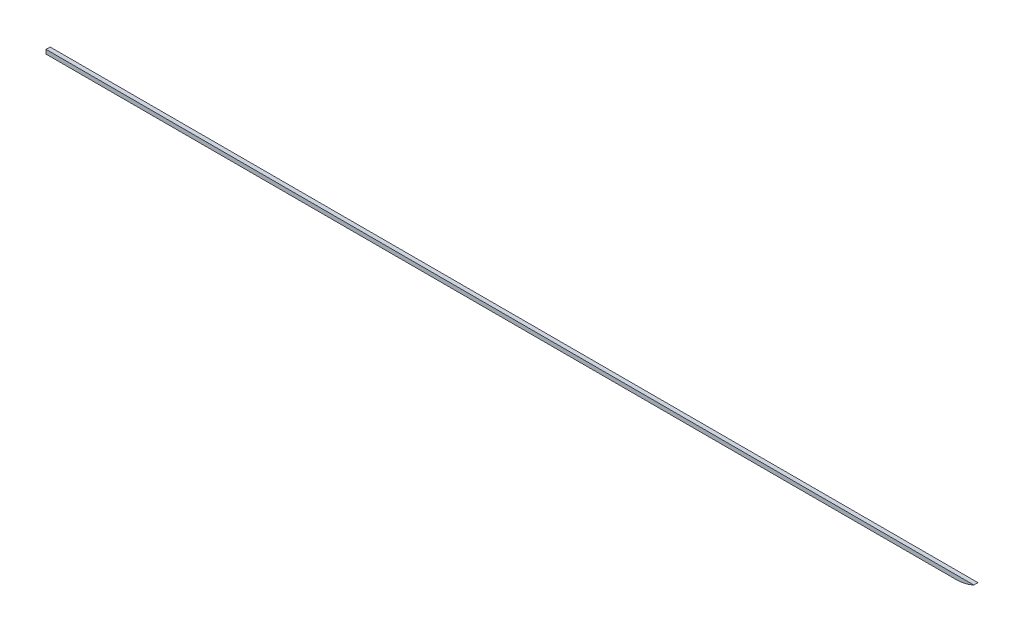
ISO-10303-21;
HEADER;
FILE_DESCRIPTION(('STEP AP214'),'2;1');
FILE_NAME('part.step','',(''),(''),'','','');
FILE_SCHEMA(('AUTOMOTIVE_DESIGN { 1 0 10303 214 1 1 1 1 }'));
ENDSEC;
DATA;
#1=APPLICATION_CONTEXT('core data for automotive mechanical design processes');
#2=APPLICATION_PROTOCOL_DEFINITION('international standard','automotive_design',2000,#1);
#3=PRODUCT_CONTEXT('',#1,'mechanical');
#4=PRODUCT('Part','Part','',(#3));
#5=PRODUCT_RELATED_PRODUCT_CATEGORY('part','',(#4));
#6=PRODUCT_DEFINITION_FORMATION('','',#4);
#7=PRODUCT_DEFINITION_CONTEXT('part definition',#1,'design');
#8=PRODUCT_DEFINITION('design','',#6,#7);
#9=PRODUCT_DEFINITION_SHAPE('','',#8);
#10=(LENGTH_UNIT() NAMED_UNIT(*) SI_UNIT(.MILLI.,.METRE.));
#11=(NAMED_UNIT(*) PLANE_ANGLE_UNIT() SI_UNIT($,.RADIAN.));
#12=(NAMED_UNIT(*) SI_UNIT($,.STERADIAN.) SOLID_ANGLE_UNIT());
#13=UNCERTAINTY_MEASURE_WITH_UNIT(LENGTH_MEASURE(1.E-05),#10,'distance_accuracy_value','');
#14=(GEOMETRIC_REPRESENTATION_CONTEXT(3) GLOBAL_UNCERTAINTY_ASSIGNED_CONTEXT((#13)) GLOBAL_UNIT_ASSIGNED_CONTEXT((#10,
#11,#12)) REPRESENTATION_CONTEXT('',''));
#15=CARTESIAN_POINT('',(0.,0.,0.));
#16=DIRECTION('',(0.,0.,1.));
#17=DIRECTION('',(1.,0.,0.));
#18=AXIS2_PLACEMENT_3D('',#15,#16,#17);
#19=CARTESIAN_POINT('',(-502.733741957931,0.,0.));
#20=DIRECTION('',(1.,0.,0.));
#21=DIRECTION('',(0.,0.,-1.));
#22=AXIS2_PLACEMENT_3D('',#19,#20,#21);
#23=PLANE('',#22);
#24=DIRECTION('',(0.,0.,-1.));
#25=VECTOR('',#24,1.);
#26=CARTESIAN_POINT('',(-502.733741957931,-50.,80.));
#27=LINE('',#26,#25);
#28=CARTESIAN_POINT('',(-502.733741957931,-50.,5.));
#29=VERTEX_POINT('',#28);
#30=CARTESIAN_POINT('',(-502.733741957931,-50.,0.));
#31=VERTEX_POINT('',#30);
#32=EDGE_CURVE('E95',#29,#31,#27,.T.);
#33=ORIENTED_EDGE('',*,*,#32,.F.);
#34=DIRECTION('',(0.,1.,0.));
#35=VECTOR('',#34,1.);
#36=CARTESIAN_POINT('',(-502.733741957931,-45.,5.));
#37=LINE('',#36,#35);
#38=CARTESIAN_POINT('',(-502.733741957931,-45.,5.));
#39=VERTEX_POINT('',#38);
#40=EDGE_CURVE('E11',#29,#39,#37,.T.);
#41=ORIENTED_EDGE('',*,*,#40,.T.);
#42=DIRECTION('',(0.,0.,-1.));
#43=VECTOR('',#42,1.);
#44=CARTESIAN_POINT('',(-502.733741957931,-45.,0.));
#45=LINE('',#44,#43);
#46=CARTESIAN_POINT('',(-502.733741957931,-45.,0.));
#47=VERTEX_POINT('',#46);
#48=EDGE_CURVE('E42',#39,#47,#45,.T.);
#49=ORIENTED_EDGE('',*,*,#48,.T.);
#50=DIRECTION('',(0.,1.,0.));
#51=VECTOR('',#50,1.);
#52=CARTESIAN_POINT('',(-502.733741957931,0.,0.));
#53=LINE('',#52,#51);
#54=EDGE_CURVE('E37',#31,#47,#53,.T.);
#55=ORIENTED_EDGE('',*,*,#54,.F.);
#56=EDGE_LOOP('',(#33,#41,#49,#55));
#57=FACE_BOUND('',#56,.T.);
#58=ADVANCED_FACE('F34',(#57),#23,.F.);
#59=CARTESIAN_POINT('',(0.,-45.,0.));
#60=DIRECTION('',(0.,1.,0.));
#61=DIRECTION('',(0.,0.,1.));
#62=AXIS2_PLACEMENT_3D('',#59,#60,#61);
#63=PLANE('',#62);
#64=ORIENTED_EDGE('',*,*,#48,.F.);
#65=DIRECTION('',(-1.,0.,0.));
#66=VECTOR('',#65,1.);
#67=CARTESIAN_POINT('',(597.266258042068,-45.,5.));
#68=LINE('',#67,#66);
#69=CARTESIAN_POINT('',(619.060752759772,-45.,5.));
#70=VERTEX_POINT('',#69);
#71=EDGE_CURVE('E87',#70,#39,#68,.T.);
#72=ORIENTED_EDGE('',*,*,#71,.F.);
#73=DIRECTION('',(0.,0.,-1.));
#74=VECTOR('',#73,1.);
#75=CARTESIAN_POINT('',(619.060752759772,-45.,80.));
#76=LINE('',#75,#74);
#77=CARTESIAN_POINT('',(619.060752759772,-45.,0.));
#78=VERTEX_POINT('',#77);
#79=EDGE_CURVE('E78',#70,#78,#76,.T.);
#80=ORIENTED_EDGE('',*,*,#79,.T.);
#81=DIRECTION('',(-1.,0.,0.));
#82=VECTOR('',#81,1.);
#83=CARTESIAN_POINT('',(-502.733741957931,-45.,0.));
#84=LINE('',#83,#82);
#85=EDGE_CURVE('E85',#78,#47,#84,.T.);
#86=ORIENTED_EDGE('',*,*,#85,.T.);
#87=EDGE_LOOP('',(#64,#72,#80,#86));
#88=FACE_BOUND('',#87,.T.);
#89=ADVANCED_FACE('F89',(#88),#63,.T.);
#90=CARTESIAN_POINT('',(-502.733741957931,0.,0.));
#91=DIRECTION('',(0.,0.,1.));
#92=DIRECTION('',(1.,0.,0.));
#93=AXIS2_PLACEMENT_3D('',#90,#91,#92);
#94=PLANE('',#93);
#95=DIRECTION('',(1.,0.,0.));
#96=VECTOR('',#95,1.);
#97=CARTESIAN_POINT('',(-502.733741957931,-50.,0.));
#98=LINE('',#97,#96);
#99=CARTESIAN_POINT('',(597.266258042068,-50.,0.));
#100=VERTEX_POINT('',#99);
#101=EDGE_CURVE('E103',#31,#100,#98,.T.);
#102=ORIENTED_EDGE('',*,*,#101,.F.);
#103=ORIENTED_EDGE('',*,*,#54,.T.);
#104=ORIENTED_EDGE('',*,*,#85,.F.);
#105=CARTESIAN_POINT('',(597.266258042068,0.,0.));
#106=DIRECTION('',(0.,0.,1.));
#107=DIRECTION('',(1.,0.,0.));
#108=AXIS2_PLACEMENT_3D('',#105,#106,#107);
#109=CIRCLE('',#108,50.);
#110=EDGE_CURVE('E74',#100,#78,#109,.T.);
#111=ORIENTED_EDGE('',*,*,#110,.F.);
#112=EDGE_LOOP('',(#102,#103,#104,#111));
#113=FACE_BOUND('',#112,.T.);
#114=ADVANCED_FACE('F86',(#113),#94,.F.);
#115=CARTESIAN_POINT('',(-502.733741957931,-50.,80.));
#116=DIRECTION('',(0.,1.,0.));
#117=DIRECTION('',(0.,0.,1.));
#118=AXIS2_PLACEMENT_3D('',#115,#116,#117);
#119=PLANE('',#118);
#120=DIRECTION('',(0.,0.,-1.));
#121=VECTOR('',#120,1.);
#122=CARTESIAN_POINT('',(597.266258042068,-50.,80.));
#123=LINE('',#122,#121);
#124=CARTESIAN_POINT('',(597.266258042068,-50.,5.));
#125=VERTEX_POINT('',#124);
#126=EDGE_CURVE('E81',#125,#100,#123,.T.);
#127=ORIENTED_EDGE('',*,*,#126,.F.);
#128=DIRECTION('',(-1.,0.,0.));
#129=VECTOR('',#128,1.);
#130=CARTESIAN_POINT('',(-502.733741957931,-50.,5.));
#131=LINE('',#130,#129);
#132=EDGE_CURVE('E83',#125,#29,#131,.T.);
#133=ORIENTED_EDGE('',*,*,#132,.T.);
#134=ORIENTED_EDGE('',*,*,#32,.T.);
#135=ORIENTED_EDGE('',*,*,#101,.T.);
#136=EDGE_LOOP('',(#127,#133,#134,#135));
#137=FACE_BOUND('',#136,.T.);
#138=ADVANCED_FACE('F107',(#137),#119,.F.);
#139=CARTESIAN_POINT('',(597.266258042068,0.,80.));
#140=DIRECTION('',(0.,0.,-1.));
#141=DIRECTION('',(-1.,0.,0.));
#142=AXIS2_PLACEMENT_3D('',#139,#140,#141);
#143=CYLINDRICAL_SURFACE('',#142,50.);
#144=ORIENTED_EDGE('',*,*,#79,.F.);
#145=CARTESIAN_POINT('',(597.266258042068,0.,5.));
#146=DIRECTION('',(0.,0.,1.));
#147=DIRECTION('',(1.,0.,0.));
#148=AXIS2_PLACEMENT_3D('',#145,#146,#147);
#149=CIRCLE('',#148,50.);
#150=EDGE_CURVE('E94',#125,#70,#149,.T.);
#151=ORIENTED_EDGE('',*,*,#150,.F.);
#152=ORIENTED_EDGE('',*,*,#126,.T.);
#153=ORIENTED_EDGE('',*,*,#110,.T.);
#154=EDGE_LOOP('',(#144,#151,#152,#153));
#155=FACE_BOUND('',#154,.T.);
#156=ADVANCED_FACE('F75',(#155),#143,.T.);
#157=CARTESIAN_POINT('',(597.266258042068,-45.,5.));
#158=DIRECTION('',(0.,0.,1.));
#159=DIRECTION('',(1.,0.,0.));
#160=AXIS2_PLACEMENT_3D('',#157,#158,#159);
#161=PLANE('',#160);
#162=ORIENTED_EDGE('',*,*,#40,.F.);
#163=ORIENTED_EDGE('',*,*,#132,.F.);
#164=ORIENTED_EDGE('',*,*,#150,.T.);
#165=ORIENTED_EDGE('',*,*,#71,.T.);
#166=EDGE_LOOP('',(#162,#163,#164,#165));
#167=FACE_BOUND('',#166,.T.);
#168=ADVANCED_FACE('F108',(#167),#161,.T.);
#169=CLOSED_SHELL('',(#58,#89,#114,#138,#156,#168));
#170=MANIFOLD_SOLID_BREP('B2',#169);
#171=ADVANCED_BREP_SHAPE_REPRESENTATION('',(#18,#170),#14);
#172=SHAPE_DEFINITION_REPRESENTATION(#9,#171);
ENDSEC;
END-ISO-10303-21;
